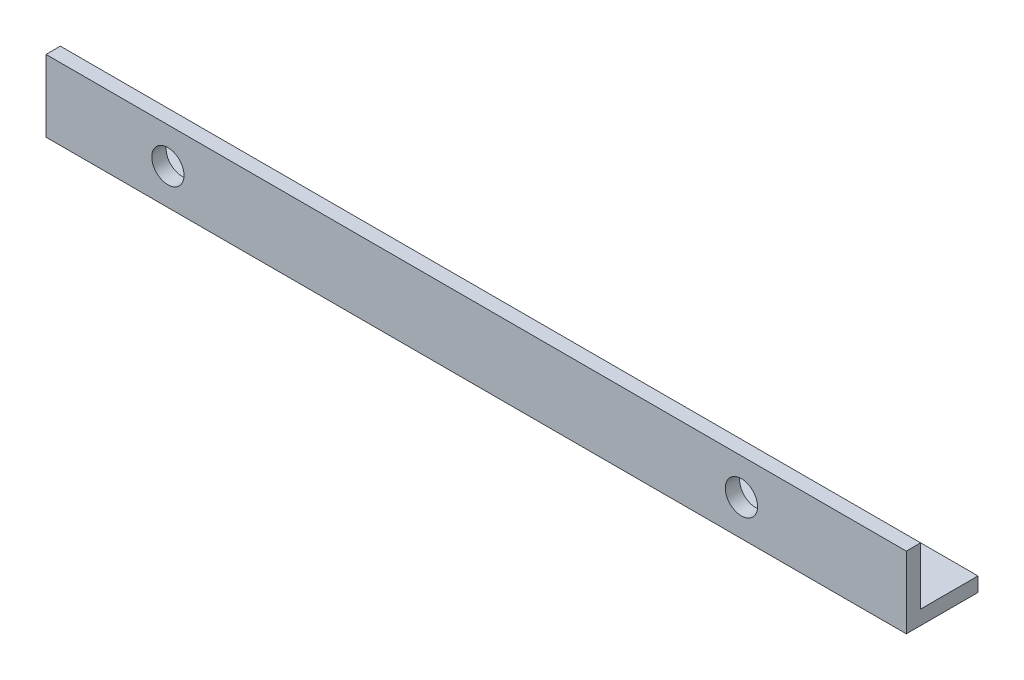
ISO-10303-21;
HEADER;
FILE_DESCRIPTION(('STEP AP214'),'2;1');
FILE_NAME('part.step','',(''),(''),'','','');
FILE_SCHEMA(('AUTOMOTIVE_DESIGN { 1 0 10303 214 1 1 1 1 }'));
ENDSEC;
DATA;
#1=APPLICATION_CONTEXT('core data for automotive mechanical design processes');
#2=APPLICATION_PROTOCOL_DEFINITION('international standard','automotive_design',2000,#1);
#3=PRODUCT_CONTEXT('',#1,'mechanical');
#4=PRODUCT('Part','Part','',(#3));
#5=PRODUCT_RELATED_PRODUCT_CATEGORY('part','',(#4));
#6=PRODUCT_DEFINITION_FORMATION('','',#4);
#7=PRODUCT_DEFINITION_CONTEXT('part definition',#1,'design');
#8=PRODUCT_DEFINITION('design','',#6,#7);
#9=PRODUCT_DEFINITION_SHAPE('','',#8);
#10=(LENGTH_UNIT() NAMED_UNIT(*) SI_UNIT(.MILLI.,.METRE.));
#11=(NAMED_UNIT(*) PLANE_ANGLE_UNIT() SI_UNIT($,.RADIAN.));
#12=(NAMED_UNIT(*) SI_UNIT($,.STERADIAN.) SOLID_ANGLE_UNIT());
#13=UNCERTAINTY_MEASURE_WITH_UNIT(LENGTH_MEASURE(1.E-05),#10,'distance_accuracy_value','');
#14=(GEOMETRIC_REPRESENTATION_CONTEXT(3) GLOBAL_UNCERTAINTY_ASSIGNED_CONTEXT((#13)) GLOBAL_UNIT_ASSIGNED_CONTEXT((#10,
#11,#12)) REPRESENTATION_CONTEXT('',''));
#15=CARTESIAN_POINT('',(0.,0.,0.));
#16=DIRECTION('',(0.,0.,1.));
#17=DIRECTION('',(1.,0.,0.));
#18=AXIS2_PLACEMENT_3D('',#15,#16,#17);
#19=CARTESIAN_POINT('',(120.,0.,-10.));
#20=DIRECTION('',(0.,1.,0.));
#21=DIRECTION('',(0.,0.,1.));
#22=AXIS2_PLACEMENT_3D('',#19,#20,#21);
#23=PLANE('',#22);
#24=CARTESIAN_POINT('',(23.,0.,-5.));
#25=DIRECTION('',(0.,-1.,0.));
#26=DIRECTION('',(0.,0.,-1.));
#27=AXIS2_PLACEMENT_3D('',#24,#25,#26);
#28=CIRCLE('',#27,2.25);
#29=CARTESIAN_POINT('',(23.,0.,-7.25));
#30=VERTEX_POINT('',#29);
#31=EDGE_CURVE('E165',#30,#30,#28,.T.);
#32=ORIENTED_EDGE('',*,*,#31,.F.);
#33=EDGE_LOOP('',(#32));
#34=FACE_BOUND('',#33,.T.);
#35=CARTESIAN_POINT('',(103.,0.,-5.));
#36=DIRECTION('',(0.,-1.,0.));
#37=DIRECTION('',(0.,0.,-1.));
#38=AXIS2_PLACEMENT_3D('',#35,#36,#37);
#39=CIRCLE('',#38,2.25);
#40=CARTESIAN_POINT('',(103.,0.,-7.25));
#41=VERTEX_POINT('',#40);
#42=EDGE_CURVE('E168',#41,#41,#39,.T.);
#43=ORIENTED_EDGE('',*,*,#42,.F.);
#44=EDGE_LOOP('',(#43));
#45=FACE_BOUND('',#44,.T.);
#46=DIRECTION('',(0.,0.,-1.));
#47=VECTOR('',#46,1.);
#48=CARTESIAN_POINT('',(0.,0.,-10.));
#49=LINE('',#48,#47);
#50=CARTESIAN_POINT('',(0.,0.,0.));
#51=VERTEX_POINT('',#50);
#52=CARTESIAN_POINT('',(0.,0.,-10.));
#53=VERTEX_POINT('',#52);
#54=EDGE_CURVE('E115',#51,#53,#49,.T.);
#55=ORIENTED_EDGE('',*,*,#54,.T.);
#56=DIRECTION('',(-1.,0.,0.));
#57=VECTOR('',#56,1.);
#58=CARTESIAN_POINT('',(120.,0.,-10.));
#59=LINE('',#58,#57);
#60=CARTESIAN_POINT('',(120.,0.,-10.));
#61=VERTEX_POINT('',#60);
#62=EDGE_CURVE('E11',#61,#53,#59,.T.);
#63=ORIENTED_EDGE('',*,*,#62,.F.);
#64=DIRECTION('',(0.,0.,-1.));
#65=VECTOR('',#64,1.);
#66=CARTESIAN_POINT('',(120.,0.,-10.));
#67=LINE('',#66,#65);
#68=CARTESIAN_POINT('',(120.,0.,0.));
#69=VERTEX_POINT('',#68);
#70=EDGE_CURVE('E126',#69,#61,#67,.T.);
#71=ORIENTED_EDGE('',*,*,#70,.F.);
#72=DIRECTION('',(-1.,0.,0.));
#73=VECTOR('',#72,1.);
#74=CARTESIAN_POINT('',(120.,0.,0.));
#75=LINE('',#74,#73);
#76=EDGE_CURVE('E111',#69,#51,#75,.T.);
#77=ORIENTED_EDGE('',*,*,#76,.T.);
#78=EDGE_LOOP('',(#55,#63,#71,#77));
#79=FACE_BOUND('',#78,.T.);
#80=ADVANCED_FACE('F31',(#34,#45,#79),#23,.F.);
#81=CARTESIAN_POINT('',(120.,2.,-10.));
#82=DIRECTION('',(0.,0.,1.));
#83=DIRECTION('',(0.,-1.,0.));
#84=AXIS2_PLACEMENT_3D('',#81,#82,#83);
#85=PLANE('',#84);
#86=DIRECTION('',(0.,1.,0.));
#87=VECTOR('',#86,1.);
#88=CARTESIAN_POINT('',(0.,2.,-10.));
#89=LINE('',#88,#87);
#90=CARTESIAN_POINT('',(0.,2.,-10.));
#91=VERTEX_POINT('',#90);
#92=EDGE_CURVE('E118',#53,#91,#89,.T.);
#93=ORIENTED_EDGE('',*,*,#92,.T.);
#94=DIRECTION('',(-1.,0.,0.));
#95=VECTOR('',#94,1.);
#96=CARTESIAN_POINT('',(120.,2.,-10.));
#97=LINE('',#96,#95);
#98=CARTESIAN_POINT('',(120.,2.,-10.));
#99=VERTEX_POINT('',#98);
#100=EDGE_CURVE('E39',#99,#91,#97,.T.);
#101=ORIENTED_EDGE('',*,*,#100,.F.);
#102=DIRECTION('',(0.,1.,0.));
#103=VECTOR('',#102,1.);
#104=CARTESIAN_POINT('',(120.,2.,-10.));
#105=LINE('',#104,#103);
#106=EDGE_CURVE('E84',#61,#99,#105,.T.);
#107=ORIENTED_EDGE('',*,*,#106,.F.);
#108=ORIENTED_EDGE('',*,*,#62,.T.);
#109=EDGE_LOOP('',(#93,#101,#107,#108));
#110=FACE_BOUND('',#109,.T.);
#111=ADVANCED_FACE('F155',(#110),#85,.F.);
#112=CARTESIAN_POINT('',(120.,2.,-2.));
#113=DIRECTION('',(0.,-1.,0.));
#114=DIRECTION('',(0.,0.,-1.));
#115=AXIS2_PLACEMENT_3D('',#112,#113,#114);
#116=PLANE('',#115);
#117=CARTESIAN_POINT('',(23.,2.,-5.));
#118=DIRECTION('',(0.,-1.,0.));
#119=DIRECTION('',(0.,0.,-1.));
#120=AXIS2_PLACEMENT_3D('',#117,#118,#119);
#121=CIRCLE('',#120,2.25);
#122=CARTESIAN_POINT('',(23.,2.,-7.25));
#123=VERTEX_POINT('',#122);
#124=EDGE_CURVE('E171',#123,#123,#121,.F.);
#125=ORIENTED_EDGE('',*,*,#124,.F.);
#126=EDGE_LOOP('',(#125));
#127=FACE_BOUND('',#126,.T.);
#128=CARTESIAN_POINT('',(103.,2.,-5.));
#129=DIRECTION('',(0.,-1.,0.));
#130=DIRECTION('',(0.,0.,-1.));
#131=AXIS2_PLACEMENT_3D('',#128,#129,#130);
#132=CIRCLE('',#131,2.25);
#133=CARTESIAN_POINT('',(103.,2.,-7.25));
#134=VERTEX_POINT('',#133);
#135=EDGE_CURVE('E170',#134,#134,#132,.F.);
#136=ORIENTED_EDGE('',*,*,#135,.F.);
#137=EDGE_LOOP('',(#136));
#138=FACE_BOUND('',#137,.T.);
#139=DIRECTION('',(0.,0.,1.));
#140=VECTOR('',#139,1.);
#141=CARTESIAN_POINT('',(0.,2.,-2.));
#142=LINE('',#141,#140);
#143=CARTESIAN_POINT('',(0.,2.,-2.));
#144=VERTEX_POINT('',#143);
#145=EDGE_CURVE('E121',#91,#144,#142,.T.);
#146=ORIENTED_EDGE('',*,*,#145,.T.);
#147=DIRECTION('',(-1.,0.,0.));
#148=VECTOR('',#147,1.);
#149=CARTESIAN_POINT('',(120.,2.,-2.));
#150=LINE('',#149,#148);
#151=CARTESIAN_POINT('',(120.,2.,-2.));
#152=VERTEX_POINT('',#151);
#153=EDGE_CURVE('E106',#152,#144,#150,.T.);
#154=ORIENTED_EDGE('',*,*,#153,.F.);
#155=DIRECTION('',(0.,0.,1.));
#156=VECTOR('',#155,1.);
#157=CARTESIAN_POINT('',(120.,2.,-2.));
#158=LINE('',#157,#156);
#159=EDGE_CURVE('E97',#99,#152,#158,.T.);
#160=ORIENTED_EDGE('',*,*,#159,.F.);
#161=ORIENTED_EDGE('',*,*,#100,.T.);
#162=EDGE_LOOP('',(#146,#154,#160,#161));
#163=FACE_BOUND('',#162,.T.);
#164=ADVANCED_FACE('F132',(#127,#138,#163),#116,.F.);
#165=CARTESIAN_POINT('',(120.,10.,-2.));
#166=DIRECTION('',(0.,0.,1.));
#167=DIRECTION('',(0.,-1.,0.));
#168=AXIS2_PLACEMENT_3D('',#165,#166,#167);
#169=PLANE('',#168);
#170=CARTESIAN_POINT('',(17.,5.,-2.));
#171=DIRECTION('',(0.,0.,1.));
#172=DIRECTION('',(0.,-1.,0.));
#173=AXIS2_PLACEMENT_3D('',#170,#171,#172);
#174=CIRCLE('',#173,2.25);
#175=CARTESIAN_POINT('',(17.,2.75,-2.));
#176=VERTEX_POINT('',#175);
#177=EDGE_CURVE('E182',#176,#176,#174,.F.);
#178=ORIENTED_EDGE('',*,*,#177,.F.);
#179=EDGE_LOOP('',(#178));
#180=FACE_BOUND('',#179,.T.);
#181=CARTESIAN_POINT('',(97.,5.,-2.));
#182=DIRECTION('',(0.,0.,1.));
#183=DIRECTION('',(0.,-1.,0.));
#184=AXIS2_PLACEMENT_3D('',#181,#182,#183);
#185=CIRCLE('',#184,2.25);
#186=CARTESIAN_POINT('',(97.,2.75,-2.));
#187=VERTEX_POINT('',#186);
#188=EDGE_CURVE('E119',#187,#187,#185,.F.);
#189=ORIENTED_EDGE('',*,*,#188,.F.);
#190=EDGE_LOOP('',(#189));
#191=FACE_BOUND('',#190,.T.);
#192=DIRECTION('',(0.,1.,0.));
#193=VECTOR('',#192,1.);
#194=CARTESIAN_POINT('',(0.,10.,-2.));
#195=LINE('',#194,#193);
#196=CARTESIAN_POINT('',(0.,10.,-2.));
#197=VERTEX_POINT('',#196);
#198=EDGE_CURVE('E105',#144,#197,#195,.T.);
#199=ORIENTED_EDGE('',*,*,#198,.T.);
#200=DIRECTION('',(-1.,0.,0.));
#201=VECTOR('',#200,1.);
#202=CARTESIAN_POINT('',(120.,10.,-2.));
#203=LINE('',#202,#201);
#204=CARTESIAN_POINT('',(120.,10.,-2.));
#205=VERTEX_POINT('',#204);
#206=EDGE_CURVE('E102',#205,#197,#203,.T.);
#207=ORIENTED_EDGE('',*,*,#206,.F.);
#208=DIRECTION('',(0.,1.,0.));
#209=VECTOR('',#208,1.);
#210=CARTESIAN_POINT('',(120.,10.,-2.));
#211=LINE('',#210,#209);
#212=EDGE_CURVE('E91',#152,#205,#211,.T.);
#213=ORIENTED_EDGE('',*,*,#212,.F.);
#214=ORIENTED_EDGE('',*,*,#153,.T.);
#215=EDGE_LOOP('',(#199,#207,#213,#214));
#216=FACE_BOUND('',#215,.T.);
#217=ADVANCED_FACE('F103',(#180,#191,#216),#169,.F.);
#218=CARTESIAN_POINT('',(120.,10.,0.));
#219=DIRECTION('',(0.,-1.,0.));
#220=DIRECTION('',(0.,0.,-1.));
#221=AXIS2_PLACEMENT_3D('',#218,#219,#220);
#222=PLANE('',#221);
#223=DIRECTION('',(0.,0.,1.));
#224=VECTOR('',#223,1.);
#225=CARTESIAN_POINT('',(0.,10.,0.));
#226=LINE('',#225,#224);
#227=CARTESIAN_POINT('',(0.,10.,0.));
#228=VERTEX_POINT('',#227);
#229=EDGE_CURVE('E70',#197,#228,#226,.T.);
#230=ORIENTED_EDGE('',*,*,#229,.T.);
#231=DIRECTION('',(-1.,0.,0.));
#232=VECTOR('',#231,1.);
#233=CARTESIAN_POINT('',(120.,10.,0.));
#234=LINE('',#233,#232);
#235=CARTESIAN_POINT('',(120.,10.,0.));
#236=VERTEX_POINT('',#235);
#237=EDGE_CURVE('E107',#236,#228,#234,.T.);
#238=ORIENTED_EDGE('',*,*,#237,.F.);
#239=DIRECTION('',(0.,0.,1.));
#240=VECTOR('',#239,1.);
#241=CARTESIAN_POINT('',(120.,10.,0.));
#242=LINE('',#241,#240);
#243=EDGE_CURVE('E95',#205,#236,#242,.T.);
#244=ORIENTED_EDGE('',*,*,#243,.F.);
#245=ORIENTED_EDGE('',*,*,#206,.T.);
#246=EDGE_LOOP('',(#230,#238,#244,#245));
#247=FACE_BOUND('',#246,.T.);
#248=ADVANCED_FACE('F109',(#247),#222,.F.);
#249=CARTESIAN_POINT('',(120.,0.,0.));
#250=DIRECTION('',(0.,0.,-1.));
#251=DIRECTION('',(-1.,0.,0.));
#252=AXIS2_PLACEMENT_3D('',#249,#250,#251);
#253=PLANE('',#252);
#254=CARTESIAN_POINT('',(17.,5.,0.));
#255=DIRECTION('',(0.,0.,1.));
#256=DIRECTION('',(1.,0.,0.));
#257=AXIS2_PLACEMENT_3D('',#254,#255,#256);
#258=CIRCLE('',#257,2.25);
#259=CARTESIAN_POINT('',(19.25,5.,0.));
#260=VERTEX_POINT('',#259);
#261=EDGE_CURVE('E174',#260,#260,#258,.T.);
#262=ORIENTED_EDGE('',*,*,#261,.F.);
#263=EDGE_LOOP('',(#262));
#264=FACE_BOUND('',#263,.T.);
#265=CARTESIAN_POINT('',(97.,5.,0.));
#266=DIRECTION('',(0.,0.,1.));
#267=DIRECTION('',(1.,0.,0.));
#268=AXIS2_PLACEMENT_3D('',#265,#266,#267);
#269=CIRCLE('',#268,2.25);
#270=CARTESIAN_POINT('',(99.25,5.,0.));
#271=VERTEX_POINT('',#270);
#272=EDGE_CURVE('E185',#271,#271,#269,.T.);
#273=ORIENTED_EDGE('',*,*,#272,.F.);
#274=EDGE_LOOP('',(#273));
#275=FACE_BOUND('',#274,.T.);
#276=DIRECTION('',(0.,-1.,0.));
#277=VECTOR('',#276,1.);
#278=CARTESIAN_POINT('',(0.,0.,0.));
#279=LINE('',#278,#277);
#280=EDGE_CURVE('E76',#228,#51,#279,.T.);
#281=ORIENTED_EDGE('',*,*,#280,.T.);
#282=ORIENTED_EDGE('',*,*,#76,.F.);
#283=DIRECTION('',(0.,-1.,0.));
#284=VECTOR('',#283,1.);
#285=CARTESIAN_POINT('',(120.,0.,0.));
#286=LINE('',#285,#284);
#287=EDGE_CURVE('E47',#236,#69,#286,.T.);
#288=ORIENTED_EDGE('',*,*,#287,.F.);
#289=ORIENTED_EDGE('',*,*,#237,.T.);
#290=EDGE_LOOP('',(#281,#282,#288,#289));
#291=FACE_BOUND('',#290,.T.);
#292=ADVANCED_FACE('F139',(#264,#275,#291),#253,.F.);
#293=CARTESIAN_POINT('',(120.,0.,0.));
#294=DIRECTION('',(-1.,0.,0.));
#295=DIRECTION('',(0.,0.,1.));
#296=AXIS2_PLACEMENT_3D('',#293,#294,#295);
#297=PLANE('',#296);
#298=ORIENTED_EDGE('',*,*,#70,.T.);
#299=ORIENTED_EDGE('',*,*,#106,.T.);
#300=ORIENTED_EDGE('',*,*,#159,.T.);
#301=ORIENTED_EDGE('',*,*,#212,.T.);
#302=ORIENTED_EDGE('',*,*,#243,.T.);
#303=ORIENTED_EDGE('',*,*,#287,.T.);
#304=EDGE_LOOP('',(#298,#299,#300,#301,#302,#303));
#305=FACE_BOUND('',#304,.T.);
#306=ADVANCED_FACE('F93',(#305),#297,.F.);
#307=CARTESIAN_POINT('',(0.,0.,0.));
#308=DIRECTION('',(-1.,0.,0.));
#309=DIRECTION('',(0.,0.,1.));
#310=AXIS2_PLACEMENT_3D('',#307,#308,#309);
#311=PLANE('',#310);
#312=ORIENTED_EDGE('',*,*,#54,.F.);
#313=ORIENTED_EDGE('',*,*,#280,.F.);
#314=ORIENTED_EDGE('',*,*,#229,.F.);
#315=ORIENTED_EDGE('',*,*,#198,.F.);
#316=ORIENTED_EDGE('',*,*,#145,.F.);
#317=ORIENTED_EDGE('',*,*,#92,.F.);
#318=EDGE_LOOP('',(#312,#313,#314,#315,#316,#317));
#319=FACE_BOUND('',#318,.T.);
#320=ADVANCED_FACE('F135',(#319),#311,.T.);
#321=CARTESIAN_POINT('',(97.,5.,-10.001));
#322=DIRECTION('',(0.,0.,1.));
#323=DIRECTION('',(1.,0.,0.));
#324=AXIS2_PLACEMENT_3D('',#321,#322,#323);
#325=CYLINDRICAL_SURFACE('',#324,2.25);
#326=ORIENTED_EDGE('',*,*,#272,.T.);
#327=EDGE_LOOP('',(#326));
#328=FACE_BOUND('',#327,.T.);
#329=ORIENTED_EDGE('',*,*,#188,.T.);
#330=EDGE_LOOP('',(#329));
#331=FACE_BOUND('',#330,.T.);
#332=ADVANCED_FACE('F193',(#328,#331),#325,.F.);
#333=CARTESIAN_POINT('',(17.,5.,-10.001));
#334=DIRECTION('',(0.,0.,1.));
#335=DIRECTION('',(1.,0.,0.));
#336=AXIS2_PLACEMENT_3D('',#333,#334,#335);
#337=CYLINDRICAL_SURFACE('',#336,2.25);
#338=ORIENTED_EDGE('',*,*,#261,.T.);
#339=EDGE_LOOP('',(#338));
#340=FACE_BOUND('',#339,.T.);
#341=ORIENTED_EDGE('',*,*,#177,.T.);
#342=EDGE_LOOP('',(#341));
#343=FACE_BOUND('',#342,.T.);
#344=ADVANCED_FACE('F204',(#340,#343),#337,.F.);
#345=CARTESIAN_POINT('',(103.,10.001,-5.));
#346=DIRECTION('',(0.,-1.,0.));
#347=DIRECTION('',(0.,0.,-1.));
#348=AXIS2_PLACEMENT_3D('',#345,#346,#347);
#349=CYLINDRICAL_SURFACE('',#348,2.25);
#350=ORIENTED_EDGE('',*,*,#42,.T.);
#351=EDGE_LOOP('',(#350));
#352=FACE_BOUND('',#351,.T.);
#353=ORIENTED_EDGE('',*,*,#135,.T.);
#354=EDGE_LOOP('',(#353));
#355=FACE_BOUND('',#354,.T.);
#356=ADVANCED_FACE('F206',(#352,#355),#349,.F.);
#357=CARTESIAN_POINT('',(23.,10.001,-5.));
#358=DIRECTION('',(0.,-1.,0.));
#359=DIRECTION('',(0.,0.,-1.));
#360=AXIS2_PLACEMENT_3D('',#357,#358,#359);
#361=CYLINDRICAL_SURFACE('',#360,2.25);
#362=ORIENTED_EDGE('',*,*,#31,.T.);
#363=EDGE_LOOP('',(#362));
#364=FACE_BOUND('',#363,.T.);
#365=ORIENTED_EDGE('',*,*,#124,.T.);
#366=EDGE_LOOP('',(#365));
#367=FACE_BOUND('',#366,.T.);
#368=ADVANCED_FACE('F212',(#364,#367),#361,.F.);
#369=CLOSED_SHELL('',(#80,#111,#164,#217,#248,#292,#306,#320,#332,#344,#356,#368));
#370=MANIFOLD_SOLID_BREP('B2',#369);
#371=ADVANCED_BREP_SHAPE_REPRESENTATION('',(#18,#370),#14);
#372=SHAPE_DEFINITION_REPRESENTATION(#9,#371);
ENDSEC;
END-ISO-10303-21;
